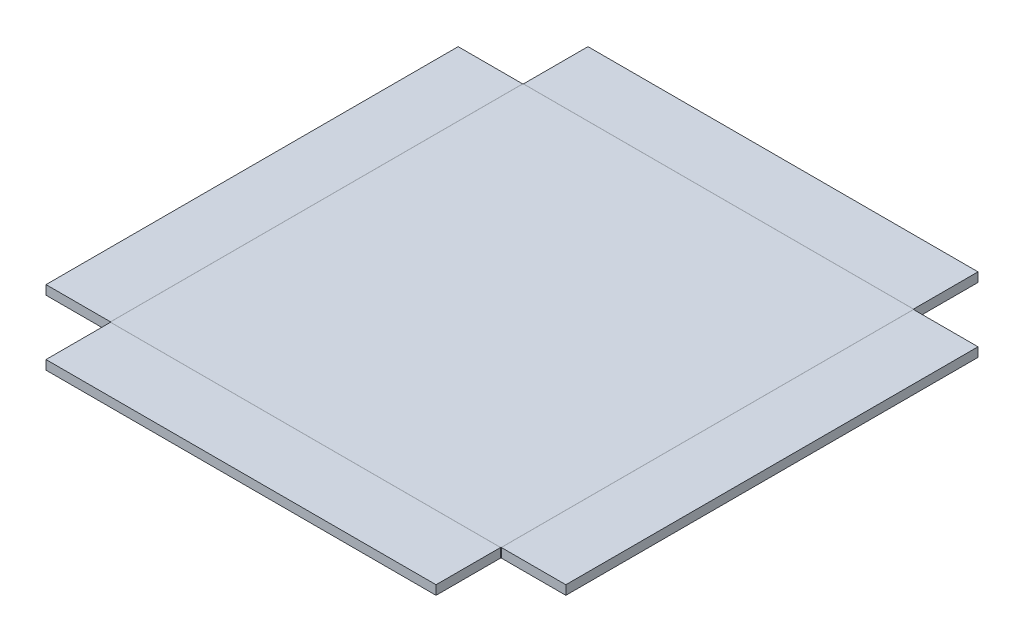
ISO-10303-21;
HEADER;
FILE_DESCRIPTION(('STEP AP214'),'2;1');
FILE_NAME('part.step','',(''),(''),'','','');
FILE_SCHEMA(('AUTOMOTIVE_DESIGN { 1 0 10303 214 1 1 1 1 }'));
ENDSEC;
DATA;
#1=APPLICATION_CONTEXT('core data for automotive mechanical design processes');
#2=APPLICATION_PROTOCOL_DEFINITION('international standard','automotive_design',2000,#1);
#3=PRODUCT_CONTEXT('',#1,'mechanical');
#4=PRODUCT('Part','Part','',(#3));
#5=PRODUCT_RELATED_PRODUCT_CATEGORY('part','',(#4));
#6=PRODUCT_DEFINITION_FORMATION('','',#4);
#7=PRODUCT_DEFINITION_CONTEXT('part definition',#1,'design');
#8=PRODUCT_DEFINITION('design','',#6,#7);
#9=PRODUCT_DEFINITION_SHAPE('','',#8);
#10=(LENGTH_UNIT() NAMED_UNIT(*) SI_UNIT(.MILLI.,.METRE.));
#11=(NAMED_UNIT(*) PLANE_ANGLE_UNIT() SI_UNIT($,.RADIAN.));
#12=(NAMED_UNIT(*) SI_UNIT($,.STERADIAN.) SOLID_ANGLE_UNIT());
#13=UNCERTAINTY_MEASURE_WITH_UNIT(LENGTH_MEASURE(1.E-05),#10,'distance_accuracy_value','');
#14=(GEOMETRIC_REPRESENTATION_CONTEXT(3) GLOBAL_UNCERTAINTY_ASSIGNED_CONTEXT((#13)) GLOBAL_UNIT_ASSIGNED_CONTEXT((#10,
#11,#12)) REPRESENTATION_CONTEXT('',''));
#15=CARTESIAN_POINT('',(0.,0.,0.));
#16=DIRECTION('',(0.,0.,1.));
#17=DIRECTION('',(1.,0.,0.));
#18=AXIS2_PLACEMENT_3D('',#15,#16,#17);
#19=CARTESIAN_POINT('',(0.,-0.254,0.));
#20=DIRECTION('',(0.,-1.,0.));
#21=DIRECTION('',(0.,0.,-1.));
#22=AXIS2_PLACEMENT_3D('',#19,#20,#21);
#23=PLANE('',#22);
#24=DIRECTION('',(0.,0.,-1.));
#25=VECTOR('',#24,1.);
#26=CARTESIAN_POINT('',(5.3848,-0.254,5.6896));
#27=LINE('',#26,#25);
#28=CARTESIAN_POINT('',(5.3848,-0.254,5.6896));
#29=VERTEX_POINT('',#28);
#30=CARTESIAN_POINT('',(5.3848,-0.254,-5.6896));
#31=VERTEX_POINT('',#30);
#32=EDGE_CURVE('E344',#29,#31,#27,.T.);
#33=ORIENTED_EDGE('',*,*,#32,.F.);
#34=DIRECTION('',(1.,0.,0.));
#35=VECTOR('',#34,1.);
#36=CARTESIAN_POINT('',(-5.3848,-0.254,5.6896));
#37=LINE('',#36,#35);
#38=CARTESIAN_POINT('',(-5.3848,-0.254,5.6896));
#39=VERTEX_POINT('',#38);
#40=EDGE_CURVE('E337',#39,#29,#37,.T.);
#41=ORIENTED_EDGE('',*,*,#40,.F.);
#42=DIRECTION('',(0.,0.,1.));
#43=VECTOR('',#42,1.);
#44=CARTESIAN_POINT('',(-5.3848,-0.254,5.6896));
#45=LINE('',#44,#43);
#46=CARTESIAN_POINT('',(-5.3848,-0.254,-5.6896));
#47=VERTEX_POINT('',#46);
#48=EDGE_CURVE('E680',#47,#39,#45,.T.);
#49=ORIENTED_EDGE('',*,*,#48,.F.);
#50=DIRECTION('',(-1.,0.,0.));
#51=VECTOR('',#50,1.);
#52=CARTESIAN_POINT('',(-5.3848,-0.254,-5.6896));
#53=LINE('',#52,#51);
#54=EDGE_CURVE('E690',#31,#47,#53,.T.);
#55=ORIENTED_EDGE('',*,*,#54,.F.);
#56=EDGE_LOOP('',(#33,#41,#49,#55));
#57=FACE_BOUND('',#56,.T.);
#58=ADVANCED_FACE('F329',(#57),#23,.T.);
#59=CARTESIAN_POINT('',(0.,0.,0.));
#60=DIRECTION('',(0.,-1.,0.));
#61=DIRECTION('',(0.,0.,-1.));
#62=AXIS2_PLACEMENT_3D('',#59,#60,#61);
#63=PLANE('',#62);
#64=DIRECTION('',(0.,0.,-1.));
#65=VECTOR('',#64,1.);
#66=CARTESIAN_POINT('',(5.3848,0.,5.6896));
#67=LINE('',#66,#65);
#68=CARTESIAN_POINT('',(5.3848,0.,5.68959999999999));
#69=VERTEX_POINT('',#68);
#70=CARTESIAN_POINT('',(5.38479999999999,0.,-5.6896));
#71=VERTEX_POINT('',#70);
#72=EDGE_CURVE('E698',#69,#71,#67,.T.);
#73=ORIENTED_EDGE('',*,*,#72,.T.);
#74=DIRECTION('',(-1.,0.,0.));
#75=VECTOR('',#74,1.);
#76=CARTESIAN_POINT('',(-5.3848,0.,-5.6896));
#77=LINE('',#76,#75);
#78=CARTESIAN_POINT('',(-5.3848,0.,-5.68959999999999));
#79=VERTEX_POINT('',#78);
#80=EDGE_CURVE('E682',#71,#79,#77,.T.);
#81=ORIENTED_EDGE('',*,*,#80,.T.);
#82=DIRECTION('',(0.,0.,1.));
#83=VECTOR('',#82,1.);
#84=CARTESIAN_POINT('',(-5.3848,0.,5.6896));
#85=LINE('',#84,#83);
#86=CARTESIAN_POINT('',(-5.38479999999998,0.,5.6896));
#87=VERTEX_POINT('',#86);
#88=EDGE_CURVE('E673',#79,#87,#85,.T.);
#89=ORIENTED_EDGE('',*,*,#88,.T.);
#90=DIRECTION('',(1.,0.,0.));
#91=VECTOR('',#90,1.);
#92=CARTESIAN_POINT('',(-5.3848,0.,5.6896));
#93=LINE('',#92,#91);
#94=EDGE_CURVE('E710',#87,#69,#93,.T.);
#95=ORIENTED_EDGE('',*,*,#94,.T.);
#96=EDGE_LOOP('',(#73,#81,#89,#95));
#97=FACE_BOUND('',#96,.T.);
#98=ADVANCED_FACE('F331',(#97),#63,.F.);
#99=CARTESIAN_POINT('',(-5.3848,-0.254,5.6896));
#100=DIRECTION('',(0.976203197631269,0.,-0.216857826546532));
#101=DIRECTION('',(-0.216857826546532,0.,-0.976203197631269));
#102=AXIS2_PLACEMENT_3D('',#99,#100,#101);
#103=PLANE('',#102);
#104=DIRECTION('',(0.,1.,0.));
#105=VECTOR('',#104,1.);
#106=CARTESIAN_POINT('',(-5.3848,-0.254,5.6896));
#107=LINE('',#106,#105);
#108=EDGE_CURVE('E716',#39,#87,#107,.T.);
#109=ORIENTED_EDGE('',*,*,#108,.T.);
#110=DIRECTION('',(-0.216857826546532,0.,-0.976203197631269));
#111=VECTOR('',#110,1.);
#112=CARTESIAN_POINT('',(-5.38479999999998,0.,5.6896));
#113=LINE('',#112,#111);
#114=CARTESIAN_POINT('',(-5.38679491133501,0.,5.68061974387893));
#115=VERTEX_POINT('',#114);
#116=EDGE_CURVE('E677',#87,#115,#113,.T.);
#117=ORIENTED_EDGE('',*,*,#116,.T.);
#118=DIRECTION('',(0.,1.,0.));
#119=VECTOR('',#118,1.);
#120=CARTESIAN_POINT('',(-5.38679491133503,-0.254,5.68061974387893));
#121=LINE('',#120,#119);
#122=CARTESIAN_POINT('',(-5.38679491133503,-0.254,5.68061974387893));
#123=VERTEX_POINT('',#122);
#124=EDGE_CURVE('E627',#123,#115,#121,.T.);
#125=ORIENTED_EDGE('',*,*,#124,.F.);
#126=DIRECTION('',(-0.216857826546532,0.,-0.976203197631269));
#127=VECTOR('',#126,1.);
#128=CARTESIAN_POINT('',(-5.3848,-0.254,5.6896));
#129=LINE('',#128,#127);
#130=EDGE_CURVE('E352',#39,#123,#129,.T.);
#131=ORIENTED_EDGE('',*,*,#130,.F.);
#132=EDGE_LOOP('',(#109,#117,#125,#131));
#133=FACE_BOUND('',#132,.T.);
#134=ADVANCED_FACE('F767',(#133),#103,.F.);
#135=CARTESIAN_POINT('',(-5.38679491133503,-0.254,-5.68061974387893));
#136=DIRECTION('',(0.976203197631269,0.,0.216857826546532));
#137=DIRECTION('',(0.216857826546532,0.,-0.976203197631269));
#138=AXIS2_PLACEMENT_3D('',#135,#136,#137);
#139=PLANE('',#138);
#140=DIRECTION('',(0.,1.,0.));
#141=VECTOR('',#140,1.);
#142=CARTESIAN_POINT('',(-5.38679491133503,-0.254,-5.68061974387893));
#143=LINE('',#142,#141);
#144=CARTESIAN_POINT('',(-5.38679491133503,-0.254,-5.68061974387893));
#145=VERTEX_POINT('',#144);
#146=CARTESIAN_POINT('',(-5.38679491133501,0.,-5.68061974387893));
#147=VERTEX_POINT('',#146);
#148=EDGE_CURVE('E664',#145,#147,#143,.T.);
#149=ORIENTED_EDGE('',*,*,#148,.T.);
#150=DIRECTION('',(0.216857826546532,0.,-0.976203197631269));
#151=VECTOR('',#150,1.);
#152=CARTESIAN_POINT('',(-5.38679491133501,0.,-5.68061974387893));
#153=LINE('',#152,#151);
#154=EDGE_CURVE('E626',#147,#79,#153,.T.);
#155=ORIENTED_EDGE('',*,*,#154,.T.);
#156=DIRECTION('',(0.,1.,0.));
#157=VECTOR('',#156,1.);
#158=CARTESIAN_POINT('',(-5.3848,-0.254,-5.6896));
#159=LINE('',#158,#157);
#160=EDGE_CURVE('E693',#47,#79,#159,.T.);
#161=ORIENTED_EDGE('',*,*,#160,.F.);
#162=DIRECTION('',(0.216857826546532,0.,-0.976203197631269));
#163=VECTOR('',#162,1.);
#164=CARTESIAN_POINT('',(-5.38679491133503,-0.254,-5.68061974387893));
#165=LINE('',#164,#163);
#166=EDGE_CURVE('E674',#145,#47,#165,.T.);
#167=ORIENTED_EDGE('',*,*,#166,.F.);
#168=EDGE_LOOP('',(#149,#155,#161,#167));
#169=FACE_BOUND('',#168,.T.);
#170=ADVANCED_FACE('F769',(#169),#139,.F.);
#171=CARTESIAN_POINT('',(0.,-0.254000000000293,0.));
#172=DIRECTION('',(0.,1.,0.));
#173=DIRECTION('',(-1.,0.,0.));
#174=AXIS2_PLACEMENT_3D('',#171,#172,#173);
#175=PLANE('',#174);
#176=ORIENTED_EDGE('',*,*,#166,.T.);
#177=ORIENTED_EDGE('',*,*,#48,.T.);
#178=ORIENTED_EDGE('',*,*,#130,.T.);
#179=DIRECTION('',(0.,0.,1.));
#180=VECTOR('',#179,1.);
#181=CARTESIAN_POINT('',(-5.38679491133503,-0.254,5.6896));
#182=LINE('',#181,#180);
#183=EDGE_CURVE('E639',#145,#123,#182,.T.);
#184=ORIENTED_EDGE('',*,*,#183,.F.);
#185=EDGE_LOOP('',(#176,#177,#178,#184));
#186=FACE_BOUND('',#185,.T.);
#187=ADVANCED_FACE('F775',(#186),#175,.F.);
#188=CARTESIAN_POINT('',(0.,-2.92680376462462E-13,0.));
#189=DIRECTION('',(0.,1.,0.));
#190=DIRECTION('',(-1.,0.,0.));
#191=AXIS2_PLACEMENT_3D('',#188,#189,#190);
#192=PLANE('',#191);
#193=ORIENTED_EDGE('',*,*,#154,.F.);
#194=DIRECTION('',(0.,0.,1.));
#195=VECTOR('',#194,1.);
#196=CARTESIAN_POINT('',(-5.38679491133503,0.,5.6896));
#197=LINE('',#196,#195);
#198=EDGE_CURVE('E618',#147,#115,#197,.T.);
#199=ORIENTED_EDGE('',*,*,#198,.T.);
#200=ORIENTED_EDGE('',*,*,#116,.F.);
#201=ORIENTED_EDGE('',*,*,#88,.F.);
#202=EDGE_LOOP('',(#193,#199,#200,#201));
#203=FACE_BOUND('',#202,.T.);
#204=ADVANCED_FACE('F764',(#203),#192,.T.);
#205=CARTESIAN_POINT('',(-7.16479491133503,0.,5.6896));
#206=DIRECTION('',(-1.,0.,0.));
#207=DIRECTION('',(0.,-1.,0.));
#208=AXIS2_PLACEMENT_3D('',#205,#206,#207);
#209=PLANE('',#208);
#210=DIRECTION('',(0.,1.,0.));
#211=VECTOR('',#210,1.);
#212=CARTESIAN_POINT('',(-7.16479491133503,0.,-5.68061974387893));
#213=LINE('',#212,#211);
#214=CARTESIAN_POINT('',(-7.16479491133503,-0.253999999999988,-5.68061974387893));
#215=VERTEX_POINT('',#214);
#216=CARTESIAN_POINT('',(-7.16479491133503,0.,-5.68061974387893));
#217=VERTEX_POINT('',#216);
#218=EDGE_CURVE('E644',#215,#217,#213,.T.);
#219=ORIENTED_EDGE('',*,*,#218,.F.);
#220=DIRECTION('',(0.,0.,-1.));
#221=VECTOR('',#220,1.);
#222=CARTESIAN_POINT('',(-7.16479491133503,-0.253999999999988,5.6896));
#223=LINE('',#222,#221);
#224=CARTESIAN_POINT('',(-7.16479491133503,-0.253999999999988,5.68061974387893));
#225=VERTEX_POINT('',#224);
#226=EDGE_CURVE('E632',#225,#215,#223,.T.);
#227=ORIENTED_EDGE('',*,*,#226,.F.);
#228=DIRECTION('',(0.,1.,0.));
#229=VECTOR('',#228,1.);
#230=CARTESIAN_POINT('',(-7.16479491133503,0.,5.68061974387893));
#231=LINE('',#230,#229);
#232=CARTESIAN_POINT('',(-7.16479491133503,0.,5.68061974387893));
#233=VERTEX_POINT('',#232);
#234=EDGE_CURVE('E661',#225,#233,#231,.T.);
#235=ORIENTED_EDGE('',*,*,#234,.T.);
#236=DIRECTION('',(0.,0.,-1.));
#237=VECTOR('',#236,1.);
#238=CARTESIAN_POINT('',(-7.16479491133503,0.,5.6896));
#239=LINE('',#238,#237);
#240=EDGE_CURVE('E656',#233,#217,#239,.T.);
#241=ORIENTED_EDGE('',*,*,#240,.T.);
#242=EDGE_LOOP('',(#219,#227,#235,#241));
#243=FACE_BOUND('',#242,.T.);
#244=ADVANCED_FACE('F819',(#243),#209,.T.);
#245=CARTESIAN_POINT('',(-5.13279491133501,0.,0.));
#246=DIRECTION('',(0.,-1.,0.));
#247=DIRECTION('',(1.,0.,0.));
#248=AXIS2_PLACEMENT_3D('',#245,#246,#247);
#249=PLANE('',#248);
#250=ORIENTED_EDGE('',*,*,#198,.F.);
#251=DIRECTION('',(-1.,0.,0.));
#252=VECTOR('',#251,1.);
#253=CARTESIAN_POINT('',(-5.13279491133501,0.,-5.68061974387893));
#254=LINE('',#253,#252);
#255=EDGE_CURVE('E652',#147,#217,#254,.T.);
#256=ORIENTED_EDGE('',*,*,#255,.T.);
#257=ORIENTED_EDGE('',*,*,#240,.F.);
#258=DIRECTION('',(-1.,0.,0.));
#259=VECTOR('',#258,1.);
#260=CARTESIAN_POINT('',(-5.13279491133501,0.,5.68061974387893));
#261=LINE('',#260,#259);
#262=EDGE_CURVE('E624',#115,#233,#261,.T.);
#263=ORIENTED_EDGE('',*,*,#262,.F.);
#264=EDGE_LOOP('',(#250,#256,#257,#263));
#265=FACE_BOUND('',#264,.T.);
#266=ADVANCED_FACE('F829',(#265),#249,.F.);
#267=CARTESIAN_POINT('',(-5.38679491133503,-0.254,-5.68061974387893));
#268=DIRECTION('',(0.,0.,1.));
#269=DIRECTION('',(-1.,0.,0.));
#270=AXIS2_PLACEMENT_3D('',#267,#268,#269);
#271=PLANE('',#270);
#272=DIRECTION('',(-1.,0.,0.));
#273=VECTOR('',#272,1.);
#274=CARTESIAN_POINT('',(-5.38679491133503,-0.254,-5.68061974387893));
#275=LINE('',#274,#273);
#276=EDGE_CURVE('E649',#145,#215,#275,.T.);
#277=ORIENTED_EDGE('',*,*,#276,.T.);
#278=ORIENTED_EDGE('',*,*,#218,.T.);
#279=ORIENTED_EDGE('',*,*,#255,.F.);
#280=ORIENTED_EDGE('',*,*,#148,.F.);
#281=EDGE_LOOP('',(#277,#278,#279,#280));
#282=FACE_BOUND('',#281,.T.);
#283=ADVANCED_FACE('F840',(#282),#271,.F.);
#284=CARTESIAN_POINT('',(-5.13279491133501,-0.254000000000002,0.));
#285=DIRECTION('',(0.,-1.,0.));
#286=DIRECTION('',(1.,0.,0.));
#287=AXIS2_PLACEMENT_3D('',#284,#285,#286);
#288=PLANE('',#287);
#289=ORIENTED_EDGE('',*,*,#276,.F.);
#290=ORIENTED_EDGE('',*,*,#183,.T.);
#291=DIRECTION('',(-1.,0.,0.));
#292=VECTOR('',#291,1.);
#293=CARTESIAN_POINT('',(-5.38679491133503,-0.254,5.68061974387893));
#294=LINE('',#293,#292);
#295=EDGE_CURVE('E636',#123,#225,#294,.T.);
#296=ORIENTED_EDGE('',*,*,#295,.T.);
#297=ORIENTED_EDGE('',*,*,#226,.T.);
#298=EDGE_LOOP('',(#289,#290,#296,#297));
#299=FACE_BOUND('',#298,.T.);
#300=ADVANCED_FACE('F851',(#299),#288,.T.);
#301=CARTESIAN_POINT('',(-5.38679491133503,-0.254,5.68061974387893));
#302=DIRECTION('',(0.,0.,1.));
#303=DIRECTION('',(-1.,0.,0.));
#304=AXIS2_PLACEMENT_3D('',#301,#302,#303);
#305=PLANE('',#304);
#306=ORIENTED_EDGE('',*,*,#234,.F.);
#307=ORIENTED_EDGE('',*,*,#295,.F.);
#308=ORIENTED_EDGE('',*,*,#124,.T.);
#309=ORIENTED_EDGE('',*,*,#262,.T.);
#310=EDGE_LOOP('',(#306,#307,#308,#309));
#311=FACE_BOUND('',#310,.T.);
#312=ADVANCED_FACE('F862',(#311),#305,.T.);
#313=CARTESIAN_POINT('',(-5.3848,-0.254,-5.6896));
#314=DIRECTION('',(0.216857826546532,0.,0.976203197631269));
#315=DIRECTION('',(0.976203197631269,0.,-0.216857826546532));
#316=AXIS2_PLACEMENT_3D('',#313,#314,#315);
#317=PLANE('',#316);
#318=ORIENTED_EDGE('',*,*,#160,.T.);
#319=DIRECTION('',(0.976203197631269,0.,-0.216857826546532));
#320=VECTOR('',#319,1.);
#321=CARTESIAN_POINT('',(-5.3848,0.,-5.68959999999999));
#322=LINE('',#321,#320);
#323=CARTESIAN_POINT('',(-5.37581974387893,0.,-5.69159491133502));
#324=VERTEX_POINT('',#323);
#325=EDGE_CURVE('E622',#79,#324,#322,.T.);
#326=ORIENTED_EDGE('',*,*,#325,.T.);
#327=DIRECTION('',(0.,1.,0.));
#328=VECTOR('',#327,1.);
#329=CARTESIAN_POINT('',(-5.37581974387893,-0.254,-5.69159491133503));
#330=LINE('',#329,#328);
#331=CARTESIAN_POINT('',(-5.37581974387893,-0.254,-5.69159491133503));
#332=VERTEX_POINT('',#331);
#333=EDGE_CURVE('E572',#332,#324,#330,.T.);
#334=ORIENTED_EDGE('',*,*,#333,.F.);
#335=DIRECTION('',(0.976203197631269,0.,-0.216857826546532));
#336=VECTOR('',#335,1.);
#337=CARTESIAN_POINT('',(-5.3848,-0.254,-5.6896));
#338=LINE('',#337,#336);
#339=EDGE_CURVE('E615',#47,#332,#338,.T.);
#340=ORIENTED_EDGE('',*,*,#339,.F.);
#341=EDGE_LOOP('',(#318,#326,#334,#340));
#342=FACE_BOUND('',#341,.T.);
#343=ADVANCED_FACE('F873',(#342),#317,.F.);
#344=CARTESIAN_POINT('',(5.37581974387893,-0.254,-5.69159491133503));
#345=DIRECTION('',(-0.216857826546532,0.,0.976203197631269));
#346=DIRECTION('',(0.976203197631269,0.,0.216857826546532));
#347=AXIS2_PLACEMENT_3D('',#344,#345,#346);
#348=PLANE('',#347);
#349=DIRECTION('',(0.,1.,0.));
#350=VECTOR('',#349,1.);
#351=CARTESIAN_POINT('',(5.37581974387893,-0.254,-5.69159491133503));
#352=LINE('',#351,#350);
#353=CARTESIAN_POINT('',(5.37581974387893,-0.254,-5.69159491133503));
#354=VERTEX_POINT('',#353);
#355=CARTESIAN_POINT('',(5.37581974387893,0.,-5.69159491133502));
#356=VERTEX_POINT('',#355);
#357=EDGE_CURVE('E607',#354,#356,#352,.T.);
#358=ORIENTED_EDGE('',*,*,#357,.T.);
#359=DIRECTION('',(0.976203197631269,0.,0.216857826546532));
#360=VECTOR('',#359,1.);
#361=CARTESIAN_POINT('',(5.37581974387893,0.,-5.69159491133502));
#362=LINE('',#361,#360);
#363=EDGE_CURVE('E571',#356,#71,#362,.T.);
#364=ORIENTED_EDGE('',*,*,#363,.T.);
#365=DIRECTION('',(0.,1.,0.));
#366=VECTOR('',#365,1.);
#367=CARTESIAN_POINT('',(5.3848,-0.254,-5.6896));
#368=LINE('',#367,#366);
#369=EDGE_CURVE('E705',#31,#71,#368,.T.);
#370=ORIENTED_EDGE('',*,*,#369,.F.);
#371=DIRECTION('',(0.976203197631269,0.,0.216857826546532));
#372=VECTOR('',#371,1.);
#373=CARTESIAN_POINT('',(5.37581974387893,-0.254,-5.69159491133503));
#374=LINE('',#373,#372);
#375=EDGE_CURVE('E619',#354,#31,#374,.T.);
#376=ORIENTED_EDGE('',*,*,#375,.F.);
#377=EDGE_LOOP('',(#358,#364,#370,#376));
#378=FACE_BOUND('',#377,.T.);
#379=ADVANCED_FACE('F885',(#378),#348,.F.);
#380=CARTESIAN_POINT('',(0.,-0.254000000000309,0.));
#381=DIRECTION('',(0.,1.,0.));
#382=DIRECTION('',(0.,0.,1.));
#383=AXIS2_PLACEMENT_3D('',#380,#381,#382);
#384=PLANE('',#383);
#385=ORIENTED_EDGE('',*,*,#375,.T.);
#386=ORIENTED_EDGE('',*,*,#54,.T.);
#387=ORIENTED_EDGE('',*,*,#339,.T.);
#388=DIRECTION('',(-1.,0.,0.));
#389=VECTOR('',#388,1.);
#390=CARTESIAN_POINT('',(-5.3848,-0.254,-5.69159491133503));
#391=LINE('',#390,#389);
#392=EDGE_CURVE('E582',#354,#332,#391,.T.);
#393=ORIENTED_EDGE('',*,*,#392,.F.);
#394=EDGE_LOOP('',(#385,#386,#387,#393));
#395=FACE_BOUND('',#394,.T.);
#396=ADVANCED_FACE('F895',(#395),#384,.F.);
#397=CARTESIAN_POINT('',(0.,-3.09214459592866E-13,0.));
#398=DIRECTION('',(0.,1.,0.));
#399=DIRECTION('',(0.,0.,1.));
#400=AXIS2_PLACEMENT_3D('',#397,#398,#399);
#401=PLANE('',#400);
#402=ORIENTED_EDGE('',*,*,#363,.F.);
#403=DIRECTION('',(-1.,0.,0.));
#404=VECTOR('',#403,1.);
#405=CARTESIAN_POINT('',(-5.3848,0.,-5.69159491133503));
#406=LINE('',#405,#404);
#407=EDGE_CURVE('E564',#356,#324,#406,.T.);
#408=ORIENTED_EDGE('',*,*,#407,.T.);
#409=ORIENTED_EDGE('',*,*,#325,.F.);
#410=ORIENTED_EDGE('',*,*,#80,.F.);
#411=EDGE_LOOP('',(#402,#408,#409,#410));
#412=FACE_BOUND('',#411,.T.);
#413=ADVANCED_FACE('F905',(#412),#401,.T.);
#414=CARTESIAN_POINT('',(-5.3848,0.,-7.46959491133503));
#415=DIRECTION('',(0.,0.,-1.));
#416=DIRECTION('',(0.,1.,0.));
#417=AXIS2_PLACEMENT_3D('',#414,#415,#416);
#418=PLANE('',#417);
#419=DIRECTION('',(0.,1.,0.));
#420=VECTOR('',#419,1.);
#421=CARTESIAN_POINT('',(5.37581974387893,0.,-7.46959491133503));
#422=LINE('',#421,#420);
#423=CARTESIAN_POINT('',(5.37581974387893,-0.253999999999988,-7.46959491133503));
#424=VERTEX_POINT('',#423);
#425=CARTESIAN_POINT('',(5.37581974387893,0.,-7.46959491133503));
#426=VERTEX_POINT('',#425);
#427=EDGE_CURVE('E587',#424,#426,#422,.T.);
#428=ORIENTED_EDGE('',*,*,#427,.F.);
#429=DIRECTION('',(1.,0.,0.));
#430=VECTOR('',#429,1.);
#431=CARTESIAN_POINT('',(-5.3848,-0.253999999999988,-7.46959491133503));
#432=LINE('',#431,#430);
#433=CARTESIAN_POINT('',(-5.37581974387893,-0.253999999999988,-7.46959491133503));
#434=VERTEX_POINT('',#433);
#435=EDGE_CURVE('E575',#434,#424,#432,.T.);
#436=ORIENTED_EDGE('',*,*,#435,.F.);
#437=DIRECTION('',(0.,1.,0.));
#438=VECTOR('',#437,1.);
#439=CARTESIAN_POINT('',(-5.37581974387893,0.,-7.46959491133503));
#440=LINE('',#439,#438);
#441=CARTESIAN_POINT('',(-5.37581974387893,0.,-7.46959491133503));
#442=VERTEX_POINT('',#441);
#443=EDGE_CURVE('E604',#434,#442,#440,.T.);
#444=ORIENTED_EDGE('',*,*,#443,.T.);
#445=DIRECTION('',(1.,0.,0.));
#446=VECTOR('',#445,1.);
#447=CARTESIAN_POINT('',(-5.3848,0.,-7.46959491133503));
#448=LINE('',#447,#446);
#449=EDGE_CURVE('E599',#442,#426,#448,.T.);
#450=ORIENTED_EDGE('',*,*,#449,.T.);
#451=EDGE_LOOP('',(#428,#436,#444,#450));
#452=FACE_BOUND('',#451,.T.);
#453=ADVANCED_FACE('F917',(#452),#418,.T.);
#454=CARTESIAN_POINT('',(0.,0.,-5.43759491133501));
#455=DIRECTION('',(0.,-1.,0.));
#456=DIRECTION('',(0.,0.,-1.));
#457=AXIS2_PLACEMENT_3D('',#454,#455,#456);
#458=PLANE('',#457);
#459=ORIENTED_EDGE('',*,*,#407,.F.);
#460=DIRECTION('',(0.,0.,-1.));
#461=VECTOR('',#460,1.);
#462=CARTESIAN_POINT('',(5.37581974387893,0.,-5.43759491133501));
#463=LINE('',#462,#461);
#464=EDGE_CURVE('E595',#356,#426,#463,.T.);
#465=ORIENTED_EDGE('',*,*,#464,.T.);
#466=ORIENTED_EDGE('',*,*,#449,.F.);
#467=DIRECTION('',(0.,0.,-1.));
#468=VECTOR('',#467,1.);
#469=CARTESIAN_POINT('',(-5.37581974387893,0.,-5.43759491133501));
#470=LINE('',#469,#468);
#471=EDGE_CURVE('E569',#324,#442,#470,.T.);
#472=ORIENTED_EDGE('',*,*,#471,.F.);
#473=EDGE_LOOP('',(#459,#465,#466,#472));
#474=FACE_BOUND('',#473,.T.);
#475=ADVANCED_FACE('F928',(#474),#458,.F.);
#476=CARTESIAN_POINT('',(5.37581974387893,-0.254,-5.69159491133503));
#477=DIRECTION('',(-1.,0.,0.));
#478=DIRECTION('',(0.,-1.,0.));
#479=AXIS2_PLACEMENT_3D('',#476,#477,#478);
#480=PLANE('',#479);
#481=DIRECTION('',(0.,0.,-1.));
#482=VECTOR('',#481,1.);
#483=CARTESIAN_POINT('',(5.37581974387893,-0.254,-5.69159491133503));
#484=LINE('',#483,#482);
#485=EDGE_CURVE('E592',#354,#424,#484,.T.);
#486=ORIENTED_EDGE('',*,*,#485,.T.);
#487=ORIENTED_EDGE('',*,*,#427,.T.);
#488=ORIENTED_EDGE('',*,*,#464,.F.);
#489=ORIENTED_EDGE('',*,*,#357,.F.);
#490=EDGE_LOOP('',(#486,#487,#488,#489));
#491=FACE_BOUND('',#490,.T.);
#492=ADVANCED_FACE('F939',(#491),#480,.F.);
#493=CARTESIAN_POINT('',(0.,-0.254000000000002,-5.43759491133501));
#494=DIRECTION('',(0.,-1.,0.));
#495=DIRECTION('',(0.,0.,-1.));
#496=AXIS2_PLACEMENT_3D('',#493,#494,#495);
#497=PLANE('',#496);
#498=ORIENTED_EDGE('',*,*,#485,.F.);
#499=ORIENTED_EDGE('',*,*,#392,.T.);
#500=DIRECTION('',(0.,0.,-1.));
#501=VECTOR('',#500,1.);
#502=CARTESIAN_POINT('',(-5.37581974387893,-0.254,-5.69159491133503));
#503=LINE('',#502,#501);
#504=EDGE_CURVE('E579',#332,#434,#503,.T.);
#505=ORIENTED_EDGE('',*,*,#504,.T.);
#506=ORIENTED_EDGE('',*,*,#435,.T.);
#507=EDGE_LOOP('',(#498,#499,#505,#506));
#508=FACE_BOUND('',#507,.T.);
#509=ADVANCED_FACE('F950',(#508),#497,.T.);
#510=CARTESIAN_POINT('',(-5.37581974387893,-0.254,-5.69159491133503));
#511=DIRECTION('',(-1.,0.,0.));
#512=DIRECTION('',(0.,-1.,0.));
#513=AXIS2_PLACEMENT_3D('',#510,#511,#512);
#514=PLANE('',#513);
#515=ORIENTED_EDGE('',*,*,#443,.F.);
#516=ORIENTED_EDGE('',*,*,#504,.F.);
#517=ORIENTED_EDGE('',*,*,#333,.T.);
#518=ORIENTED_EDGE('',*,*,#471,.T.);
#519=EDGE_LOOP('',(#515,#516,#517,#518));
#520=FACE_BOUND('',#519,.T.);
#521=ADVANCED_FACE('F961',(#520),#514,.T.);
#522=CARTESIAN_POINT('',(5.3848,-0.254,-5.6896));
#523=DIRECTION('',(-0.976203197631269,0.,0.216857826546532));
#524=DIRECTION('',(0.216857826546532,0.,0.976203197631269));
#525=AXIS2_PLACEMENT_3D('',#522,#523,#524);
#526=PLANE('',#525);
#527=ORIENTED_EDGE('',*,*,#369,.T.);
#528=DIRECTION('',(0.216857826546532,0.,0.976203197631269));
#529=VECTOR('',#528,1.);
#530=CARTESIAN_POINT('',(5.38479999999999,0.,-5.6896));
#531=LINE('',#530,#529);
#532=CARTESIAN_POINT('',(5.38679491133502,0.,-5.68061974387893));
#533=VERTEX_POINT('',#532);
#534=EDGE_CURVE('E567',#71,#533,#531,.T.);
#535=ORIENTED_EDGE('',*,*,#534,.T.);
#536=DIRECTION('',(0.,1.,0.));
#537=VECTOR('',#536,1.);
#538=CARTESIAN_POINT('',(5.38679491133503,-0.254,-5.68061974387893));
#539=LINE('',#538,#537);
#540=CARTESIAN_POINT('',(5.38679491133503,-0.254,-5.68061974387893));
#541=VERTEX_POINT('',#540);
#542=EDGE_CURVE('E518',#541,#533,#539,.T.);
#543=ORIENTED_EDGE('',*,*,#542,.F.);
#544=DIRECTION('',(0.216857826546532,0.,0.976203197631269));
#545=VECTOR('',#544,1.);
#546=CARTESIAN_POINT('',(5.3848,-0.254,-5.6896));
#547=LINE('',#546,#545);
#548=EDGE_CURVE('E561',#31,#541,#547,.T.);
#549=ORIENTED_EDGE('',*,*,#548,.F.);
#550=EDGE_LOOP('',(#527,#535,#543,#549));
#551=FACE_BOUND('',#550,.T.);
#552=ADVANCED_FACE('F972',(#551),#526,.F.);
#553=CARTESIAN_POINT('',(5.38679491133503,-0.254,5.68061974387893));
#554=DIRECTION('',(-0.976203197631269,0.,-0.216857826546532));
#555=DIRECTION('',(-0.216857826546532,0.,0.976203197631269));
#556=AXIS2_PLACEMENT_3D('',#553,#554,#555);
#557=PLANE('',#556);
#558=DIRECTION('',(0.,1.,0.));
#559=VECTOR('',#558,1.);
#560=CARTESIAN_POINT('',(5.38679491133503,-0.254,5.68061974387893));
#561=LINE('',#560,#559);
#562=CARTESIAN_POINT('',(5.38679491133503,-0.254,5.68061974387893));
#563=VERTEX_POINT('',#562);
#564=CARTESIAN_POINT('',(5.38679491133502,0.,5.68061974387893));
#565=VERTEX_POINT('',#564);
#566=EDGE_CURVE('E553',#563,#565,#561,.T.);
#567=ORIENTED_EDGE('',*,*,#566,.T.);
#568=DIRECTION('',(-0.216857826546532,0.,0.976203197631269));
#569=VECTOR('',#568,1.);
#570=CARTESIAN_POINT('',(5.38679491133502,0.,5.68061974387893));
#571=LINE('',#570,#569);
#572=EDGE_CURVE('E517',#565,#69,#571,.T.);
#573=ORIENTED_EDGE('',*,*,#572,.T.);
#574=DIRECTION('',(0.,1.,0.));
#575=VECTOR('',#574,1.);
#576=CARTESIAN_POINT('',(5.3848,-0.254,5.6896));
#577=LINE('',#576,#575);
#578=EDGE_CURVE('E13',#29,#69,#577,.T.);
#579=ORIENTED_EDGE('',*,*,#578,.F.);
#580=DIRECTION('',(-0.216857826546532,0.,0.976203197631269));
#581=VECTOR('',#580,1.);
#582=CARTESIAN_POINT('',(5.38679491133503,-0.254,5.68061974387893));
#583=LINE('',#582,#581);
#584=EDGE_CURVE('E565',#563,#29,#583,.T.);
#585=ORIENTED_EDGE('',*,*,#584,.F.);
#586=EDGE_LOOP('',(#567,#573,#579,#585));
#587=FACE_BOUND('',#586,.T.);
#588=ADVANCED_FACE('F984',(#587),#557,.F.);
#589=CARTESIAN_POINT('',(0.,-0.254000000000293,0.));
#590=DIRECTION('',(0.,1.,0.));
#591=DIRECTION('',(-1.,0.,0.));
#592=AXIS2_PLACEMENT_3D('',#589,#590,#591);
#593=PLANE('',#592);
#594=ORIENTED_EDGE('',*,*,#584,.T.);
#595=ORIENTED_EDGE('',*,*,#32,.T.);
#596=ORIENTED_EDGE('',*,*,#548,.T.);
#597=DIRECTION('',(0.,0.,-1.));
#598=VECTOR('',#597,1.);
#599=CARTESIAN_POINT('',(5.38679491133503,-0.254,-5.6896));
#600=LINE('',#599,#598);
#601=EDGE_CURVE('E528',#563,#541,#600,.T.);
#602=ORIENTED_EDGE('',*,*,#601,.F.);
#603=EDGE_LOOP('',(#594,#595,#596,#602));
#604=FACE_BOUND('',#603,.T.);
#605=ADVANCED_FACE('F994',(#604),#593,.F.);
#606=CARTESIAN_POINT('',(0.,-2.92680376462462E-13,0.));
#607=DIRECTION('',(0.,1.,0.));
#608=DIRECTION('',(-1.,0.,0.));
#609=AXIS2_PLACEMENT_3D('',#606,#607,#608);
#610=PLANE('',#609);
#611=ORIENTED_EDGE('',*,*,#572,.F.);
#612=DIRECTION('',(0.,0.,-1.));
#613=VECTOR('',#612,1.);
#614=CARTESIAN_POINT('',(5.38679491133503,0.,-5.6896));
#615=LINE('',#614,#613);
#616=EDGE_CURVE('E506',#565,#533,#615,.T.);
#617=ORIENTED_EDGE('',*,*,#616,.T.);
#618=ORIENTED_EDGE('',*,*,#534,.F.);
#619=ORIENTED_EDGE('',*,*,#72,.F.);
#620=EDGE_LOOP('',(#611,#617,#618,#619));
#621=FACE_BOUND('',#620,.T.);
#622=ADVANCED_FACE('F1004',(#621),#610,.T.);
#623=CARTESIAN_POINT('',(7.16479491133503,0.,-5.6896));
#624=DIRECTION('',(1.,0.,0.));
#625=DIRECTION('',(0.,1.,0.));
#626=AXIS2_PLACEMENT_3D('',#623,#624,#625);
#627=PLANE('',#626);
#628=DIRECTION('',(0.,1.,0.));
#629=VECTOR('',#628,1.);
#630=CARTESIAN_POINT('',(7.16479491133503,0.,5.68061974387893));
#631=LINE('',#630,#629);
#632=CARTESIAN_POINT('',(7.16479491133503,-0.253999999999988,5.68061974387893));
#633=VERTEX_POINT('',#632);
#634=CARTESIAN_POINT('',(7.16479491133503,0.,5.68061974387893));
#635=VERTEX_POINT('',#634);
#636=EDGE_CURVE('E533',#633,#635,#631,.T.);
#637=ORIENTED_EDGE('',*,*,#636,.F.);
#638=DIRECTION('',(0.,0.,1.));
#639=VECTOR('',#638,1.);
#640=CARTESIAN_POINT('',(7.16479491133503,-0.253999999999988,-5.6896));
#641=LINE('',#640,#639);
#642=CARTESIAN_POINT('',(7.16479491133503,-0.253999999999988,-5.68061974387893));
#643=VERTEX_POINT('',#642);
#644=EDGE_CURVE('E521',#643,#633,#641,.T.);
#645=ORIENTED_EDGE('',*,*,#644,.F.);
#646=DIRECTION('',(0.,1.,0.));
#647=VECTOR('',#646,1.);
#648=CARTESIAN_POINT('',(7.16479491133503,0.,-5.68061974387893));
#649=LINE('',#648,#647);
#650=CARTESIAN_POINT('',(7.16479491133503,0.,-5.68061974387893));
#651=VERTEX_POINT('',#650);
#652=EDGE_CURVE('E550',#643,#651,#649,.T.);
#653=ORIENTED_EDGE('',*,*,#652,.T.);
#654=DIRECTION('',(0.,0.,1.));
#655=VECTOR('',#654,1.);
#656=CARTESIAN_POINT('',(7.16479491133503,0.,-5.6896));
#657=LINE('',#656,#655);
#658=EDGE_CURVE('E545',#651,#635,#657,.T.);
#659=ORIENTED_EDGE('',*,*,#658,.T.);
#660=EDGE_LOOP('',(#637,#645,#653,#659));
#661=FACE_BOUND('',#660,.T.);
#662=ADVANCED_FACE('F1016',(#661),#627,.T.);
#663=CARTESIAN_POINT('',(5.13279491133501,0.,0.));
#664=DIRECTION('',(0.,-1.,0.));
#665=DIRECTION('',(1.,0.,0.));
#666=AXIS2_PLACEMENT_3D('',#663,#664,#665);
#667=PLANE('',#666);
#668=ORIENTED_EDGE('',*,*,#616,.F.);
#669=DIRECTION('',(1.,0.,0.));
#670=VECTOR('',#669,1.);
#671=CARTESIAN_POINT('',(5.13279491133501,0.,5.68061974387893));
#672=LINE('',#671,#670);
#673=EDGE_CURVE('E541',#565,#635,#672,.T.);
#674=ORIENTED_EDGE('',*,*,#673,.T.);
#675=ORIENTED_EDGE('',*,*,#658,.F.);
#676=DIRECTION('',(1.,0.,0.));
#677=VECTOR('',#676,1.);
#678=CARTESIAN_POINT('',(5.13279491133501,0.,-5.68061974387893));
#679=LINE('',#678,#677);
#680=EDGE_CURVE('E515',#533,#651,#679,.T.);
#681=ORIENTED_EDGE('',*,*,#680,.F.);
#682=EDGE_LOOP('',(#668,#674,#675,#681));
#683=FACE_BOUND('',#682,.T.);
#684=ADVANCED_FACE('F1027',(#683),#667,.F.);
#685=CARTESIAN_POINT('',(5.38679491133503,-0.254,5.68061974387893));
#686=DIRECTION('',(0.,0.,-1.));
#687=DIRECTION('',(-1.,0.,0.));
#688=AXIS2_PLACEMENT_3D('',#685,#686,#687);
#689=PLANE('',#688);
#690=DIRECTION('',(1.,0.,0.));
#691=VECTOR('',#690,1.);
#692=CARTESIAN_POINT('',(5.38679491133503,-0.254,5.68061974387893));
#693=LINE('',#692,#691);
#694=EDGE_CURVE('E538',#563,#633,#693,.T.);
#695=ORIENTED_EDGE('',*,*,#694,.T.);
#696=ORIENTED_EDGE('',*,*,#636,.T.);
#697=ORIENTED_EDGE('',*,*,#673,.F.);
#698=ORIENTED_EDGE('',*,*,#566,.F.);
#699=EDGE_LOOP('',(#695,#696,#697,#698));
#700=FACE_BOUND('',#699,.T.);
#701=ADVANCED_FACE('F1038',(#700),#689,.F.);
#702=CARTESIAN_POINT('',(5.13279491133501,-0.254000000000002,0.));
#703=DIRECTION('',(0.,-1.,0.));
#704=DIRECTION('',(1.,0.,0.));
#705=AXIS2_PLACEMENT_3D('',#702,#703,#704);
#706=PLANE('',#705);
#707=ORIENTED_EDGE('',*,*,#694,.F.);
#708=ORIENTED_EDGE('',*,*,#601,.T.);
#709=DIRECTION('',(1.,0.,0.));
#710=VECTOR('',#709,1.);
#711=CARTESIAN_POINT('',(5.38679491133503,-0.254,-5.68061974387893));
#712=LINE('',#711,#710);
#713=EDGE_CURVE('E525',#541,#643,#712,.T.);
#714=ORIENTED_EDGE('',*,*,#713,.T.);
#715=ORIENTED_EDGE('',*,*,#644,.T.);
#716=EDGE_LOOP('',(#707,#708,#714,#715));
#717=FACE_BOUND('',#716,.T.);
#718=ADVANCED_FACE('F1049',(#717),#706,.T.);
#719=CARTESIAN_POINT('',(5.38679491133503,-0.254,-5.68061974387893));
#720=DIRECTION('',(0.,0.,-1.));
#721=DIRECTION('',(-1.,0.,0.));
#722=AXIS2_PLACEMENT_3D('',#719,#720,#721);
#723=PLANE('',#722);
#724=ORIENTED_EDGE('',*,*,#652,.F.);
#725=ORIENTED_EDGE('',*,*,#713,.F.);
#726=ORIENTED_EDGE('',*,*,#542,.T.);
#727=ORIENTED_EDGE('',*,*,#680,.T.);
#728=EDGE_LOOP('',(#724,#725,#726,#727));
#729=FACE_BOUND('',#728,.T.);
#730=ADVANCED_FACE('F1060',(#729),#723,.T.);
#731=CARTESIAN_POINT('',(5.3848,-0.254,5.6896));
#732=DIRECTION('',(-0.216857826546532,0.,-0.976203197631269));
#733=DIRECTION('',(-0.976203197631269,0.,0.216857826546532));
#734=AXIS2_PLACEMENT_3D('',#731,#732,#733);
#735=PLANE('',#734);
#736=ORIENTED_EDGE('',*,*,#578,.T.);
#737=DIRECTION('',(-0.976203197631269,0.,0.216857826546532));
#738=VECTOR('',#737,1.);
#739=CARTESIAN_POINT('',(5.3848,0.,5.68959999999999));
#740=LINE('',#739,#738);
#741=CARTESIAN_POINT('',(5.37581974387893,0.,5.69159491133501));
#742=VERTEX_POINT('',#741);
#743=EDGE_CURVE('E510',#69,#742,#740,.T.);
#744=ORIENTED_EDGE('',*,*,#743,.T.);
#745=DIRECTION('',(0.,1.,0.));
#746=VECTOR('',#745,1.);
#747=CARTESIAN_POINT('',(5.37581974387893,-0.254,5.69159491133503));
#748=LINE('',#747,#746);
#749=CARTESIAN_POINT('',(5.37581974387893,-0.254,5.69159491133503));
#750=VERTEX_POINT('',#749);
#751=EDGE_CURVE('E478',#750,#742,#748,.T.);
#752=ORIENTED_EDGE('',*,*,#751,.F.);
#753=DIRECTION('',(-0.976203197631269,0.,0.216857826546532));
#754=VECTOR('',#753,1.);
#755=CARTESIAN_POINT('',(5.3848,-0.254,5.6896));
#756=LINE('',#755,#754);
#757=EDGE_CURVE('E503',#29,#750,#756,.T.);
#758=ORIENTED_EDGE('',*,*,#757,.F.);
#759=EDGE_LOOP('',(#736,#744,#752,#758));
#760=FACE_BOUND('',#759,.T.);
#761=ADVANCED_FACE('F726',(#760),#735,.F.);
#762=CARTESIAN_POINT('',(-5.37581974387893,-0.254,5.69159491133503));
#763=DIRECTION('',(0.216857826546532,0.,-0.976203197631269));
#764=DIRECTION('',(-0.976203197631269,0.,-0.216857826546532));
#765=AXIS2_PLACEMENT_3D('',#762,#763,#764);
#766=PLANE('',#765);
#767=DIRECTION('',(0.,1.,0.));
#768=VECTOR('',#767,1.);
#769=CARTESIAN_POINT('',(-5.37581974387893,-0.254,5.69159491133503));
#770=LINE('',#769,#768);
#771=CARTESIAN_POINT('',(-5.37581974387893,-0.254,5.69159491133503));
#772=VERTEX_POINT('',#771);
#773=CARTESIAN_POINT('',(-5.37581974387893,0.,5.69159491133501));
#774=VERTEX_POINT('',#773);
#775=EDGE_CURVE('E494',#772,#774,#770,.T.);
#776=ORIENTED_EDGE('',*,*,#775,.T.);
#777=DIRECTION('',(-0.976203197631269,0.,-0.216857826546532));
#778=VECTOR('',#777,1.);
#779=CARTESIAN_POINT('',(-5.37581974387893,0.,5.69159491133501));
#780=LINE('',#779,#778);
#781=EDGE_CURVE('E511',#774,#87,#780,.T.);
#782=ORIENTED_EDGE('',*,*,#781,.T.);
#783=ORIENTED_EDGE('',*,*,#108,.F.);
#784=DIRECTION('',(-0.976203197631269,0.,-0.216857826546532));
#785=VECTOR('',#784,1.);
#786=CARTESIAN_POINT('',(-5.37581974387893,-0.254,5.69159491133503));
#787=LINE('',#786,#785);
#788=EDGE_CURVE('E507',#772,#39,#787,.T.);
#789=ORIENTED_EDGE('',*,*,#788,.F.);
#790=EDGE_LOOP('',(#776,#782,#783,#789));
#791=FACE_BOUND('',#790,.T.);
#792=ADVANCED_FACE('F753',(#791),#766,.F.);
#793=CARTESIAN_POINT('',(0.,-0.254000000000309,0.));
#794=DIRECTION('',(0.,1.,0.));
#795=DIRECTION('',(0.,0.,1.));
#796=AXIS2_PLACEMENT_3D('',#793,#794,#795);
#797=PLANE('',#796);
#798=ORIENTED_EDGE('',*,*,#788,.T.);
#799=ORIENTED_EDGE('',*,*,#40,.T.);
#800=ORIENTED_EDGE('',*,*,#757,.T.);
#801=DIRECTION('',(1.,0.,0.));
#802=VECTOR('',#801,1.);
#803=CARTESIAN_POINT('',(5.3848,-0.254,5.69159491133503));
#804=LINE('',#803,#802);
#805=EDGE_CURVE('E474',#772,#750,#804,.T.);
#806=ORIENTED_EDGE('',*,*,#805,.F.);
#807=EDGE_LOOP('',(#798,#799,#800,#806));
#808=FACE_BOUND('',#807,.T.);
#809=ADVANCED_FACE('F722',(#808),#797,.F.);
#810=CARTESIAN_POINT('',(0.,-3.09214459592866E-13,0.));
#811=DIRECTION('',(0.,1.,0.));
#812=DIRECTION('',(0.,0.,1.));
#813=AXIS2_PLACEMENT_3D('',#810,#811,#812);
#814=PLANE('',#813);
#815=ORIENTED_EDGE('',*,*,#781,.F.);
#816=DIRECTION('',(1.,0.,0.));
#817=VECTOR('',#816,1.);
#818=CARTESIAN_POINT('',(5.3848,0.,5.69159491133503));
#819=LINE('',#818,#817);
#820=EDGE_CURVE('E497',#774,#742,#819,.T.);
#821=ORIENTED_EDGE('',*,*,#820,.T.);
#822=ORIENTED_EDGE('',*,*,#743,.F.);
#823=ORIENTED_EDGE('',*,*,#94,.F.);
#824=EDGE_LOOP('',(#815,#821,#822,#823));
#825=FACE_BOUND('',#824,.T.);
#826=ADVANCED_FACE('F756',(#825),#814,.T.);
#827=CARTESIAN_POINT('',(-5.3848,0.,7.46959491133503));
#828=DIRECTION('',(0.,0.,1.));
#829=DIRECTION('',(0.,-1.,0.));
#830=AXIS2_PLACEMENT_3D('',#827,#828,#829);
#831=PLANE('',#830);
#832=DIRECTION('',(0.,1.,0.));
#833=VECTOR('',#832,1.);
#834=CARTESIAN_POINT('',(-5.37581974387893,0.,7.46959491133503));
#835=LINE('',#834,#833);
#836=CARTESIAN_POINT('',(-5.37581974387893,-0.253999999999988,7.46959491133503));
#837=VERTEX_POINT('',#836);
#838=CARTESIAN_POINT('',(-5.37581974387893,0.,7.46959491133503));
#839=VERTEX_POINT('',#838);
#840=EDGE_CURVE('E486',#837,#839,#835,.T.);
#841=ORIENTED_EDGE('',*,*,#840,.F.);
#842=DIRECTION('',(-1.,0.,0.));
#843=VECTOR('',#842,1.);
#844=CARTESIAN_POINT('',(-5.3848,-0.253999999999988,7.46959491133503));
#845=LINE('',#844,#843);
#846=CARTESIAN_POINT('',(5.37581974387893,-0.253999999999988,7.46959491133503));
#847=VERTEX_POINT('',#846);
#848=EDGE_CURVE('E473',#847,#837,#845,.T.);
#849=ORIENTED_EDGE('',*,*,#848,.F.);
#850=DIRECTION('',(0.,1.,0.));
#851=VECTOR('',#850,1.);
#852=CARTESIAN_POINT('',(5.37581974387893,0.,7.46959491133503));
#853=LINE('',#852,#851);
#854=CARTESIAN_POINT('',(5.37581974387893,0.,7.46959491133503));
#855=VERTEX_POINT('',#854);
#856=EDGE_CURVE('E484',#847,#855,#853,.T.);
#857=ORIENTED_EDGE('',*,*,#856,.T.);
#858=DIRECTION('',(-1.,0.,0.));
#859=VECTOR('',#858,1.);
#860=CARTESIAN_POINT('',(-5.3848,0.,7.46959491133503));
#861=LINE('',#860,#859);
#862=EDGE_CURVE('E493',#855,#839,#861,.T.);
#863=ORIENTED_EDGE('',*,*,#862,.T.);
#864=EDGE_LOOP('',(#841,#849,#857,#863));
#865=FACE_BOUND('',#864,.T.);
#866=ADVANCED_FACE('F482',(#865),#831,.T.);
#867=CARTESIAN_POINT('',(0.,0.,5.43759491133501));
#868=DIRECTION('',(0.,1.,0.));
#869=DIRECTION('',(0.,0.,1.));
#870=AXIS2_PLACEMENT_3D('',#867,#868,#869);
#871=PLANE('',#870);
#872=DIRECTION('',(0.,0.,-1.));
#873=VECTOR('',#872,1.);
#874=CARTESIAN_POINT('',(-5.37581974387893,0.,5.43759491133501));
#875=LINE('',#874,#873);
#876=EDGE_CURVE('E487',#839,#774,#875,.T.);
#877=ORIENTED_EDGE('',*,*,#876,.F.);
#878=ORIENTED_EDGE('',*,*,#862,.F.);
#879=DIRECTION('',(0.,0.,-1.));
#880=VECTOR('',#879,1.);
#881=CARTESIAN_POINT('',(5.37581974387893,0.,5.43759491133501));
#882=LINE('',#881,#880);
#883=EDGE_CURVE('E492',#855,#742,#882,.T.);
#884=ORIENTED_EDGE('',*,*,#883,.T.);
#885=ORIENTED_EDGE('',*,*,#820,.F.);
#886=EDGE_LOOP('',(#877,#878,#884,#885));
#887=FACE_BOUND('',#886,.T.);
#888=ADVANCED_FACE('F747',(#887),#871,.T.);
#889=CARTESIAN_POINT('',(-5.37581974387893,-0.254,5.69159491133503));
#890=DIRECTION('',(1.,0.,0.));
#891=DIRECTION('',(0.,-1.,0.));
#892=AXIS2_PLACEMENT_3D('',#889,#890,#891);
#893=PLANE('',#892);
#894=DIRECTION('',(0.,0.,1.));
#895=VECTOR('',#894,1.);
#896=CARTESIAN_POINT('',(-5.37581974387893,-0.254,5.69159491133503));
#897=LINE('',#896,#895);
#898=EDGE_CURVE('E741',#772,#837,#897,.T.);
#899=ORIENTED_EDGE('',*,*,#898,.T.);
#900=ORIENTED_EDGE('',*,*,#840,.T.);
#901=ORIENTED_EDGE('',*,*,#876,.T.);
#902=ORIENTED_EDGE('',*,*,#775,.F.);
#903=EDGE_LOOP('',(#899,#900,#901,#902));
#904=FACE_BOUND('',#903,.T.);
#905=ADVANCED_FACE('F750',(#904),#893,.F.);
#906=CARTESIAN_POINT('',(0.,-0.254000000000002,5.43759491133501));
#907=DIRECTION('',(0.,1.,0.));
#908=DIRECTION('',(0.,0.,1.));
#909=AXIS2_PLACEMENT_3D('',#906,#907,#908);
#910=PLANE('',#909);
#911=ORIENTED_EDGE('',*,*,#848,.T.);
#912=ORIENTED_EDGE('',*,*,#898,.F.);
#913=ORIENTED_EDGE('',*,*,#805,.T.);
#914=DIRECTION('',(0.,0.,1.));
#915=VECTOR('',#914,1.);
#916=CARTESIAN_POINT('',(5.37581974387893,-0.254,5.69159491133503));
#917=LINE('',#916,#915);
#918=EDGE_CURVE('E469',#750,#847,#917,.T.);
#919=ORIENTED_EDGE('',*,*,#918,.T.);
#920=EDGE_LOOP('',(#911,#912,#913,#919));
#921=FACE_BOUND('',#920,.T.);
#922=ADVANCED_FACE('F471',(#921),#910,.F.);
#923=CARTESIAN_POINT('',(5.37581974387893,-0.254,5.69159491133503));
#924=DIRECTION('',(1.,0.,0.));
#925=DIRECTION('',(0.,-1.,0.));
#926=AXIS2_PLACEMENT_3D('',#923,#924,#925);
#927=PLANE('',#926);
#928=ORIENTED_EDGE('',*,*,#856,.F.);
#929=ORIENTED_EDGE('',*,*,#918,.F.);
#930=ORIENTED_EDGE('',*,*,#751,.T.);
#931=ORIENTED_EDGE('',*,*,#883,.F.);
#932=EDGE_LOOP('',(#928,#929,#930,#931));
#933=FACE_BOUND('',#932,.T.);
#934=ADVANCED_FACE('F490',(#933),#927,.T.);
#935=CLOSED_SHELL('',(#58,#98,#134,#170,#187,#204,#244,#266,#283,#300,#312,#343,#379,#396,#413,
#453,#475,#492,#509,#521,#552,#588,#605,#622,#662,#684,#701,#718,#730,#761,#792,#809,#826,#866,
#888,#905,#922,#934));
#936=MANIFOLD_SOLID_BREP('B2',#935);
#937=ADVANCED_BREP_SHAPE_REPRESENTATION('',(#18,#936),#14);
#938=SHAPE_DEFINITION_REPRESENTATION(#9,#937);
ENDSEC;
END-ISO-10303-21;
